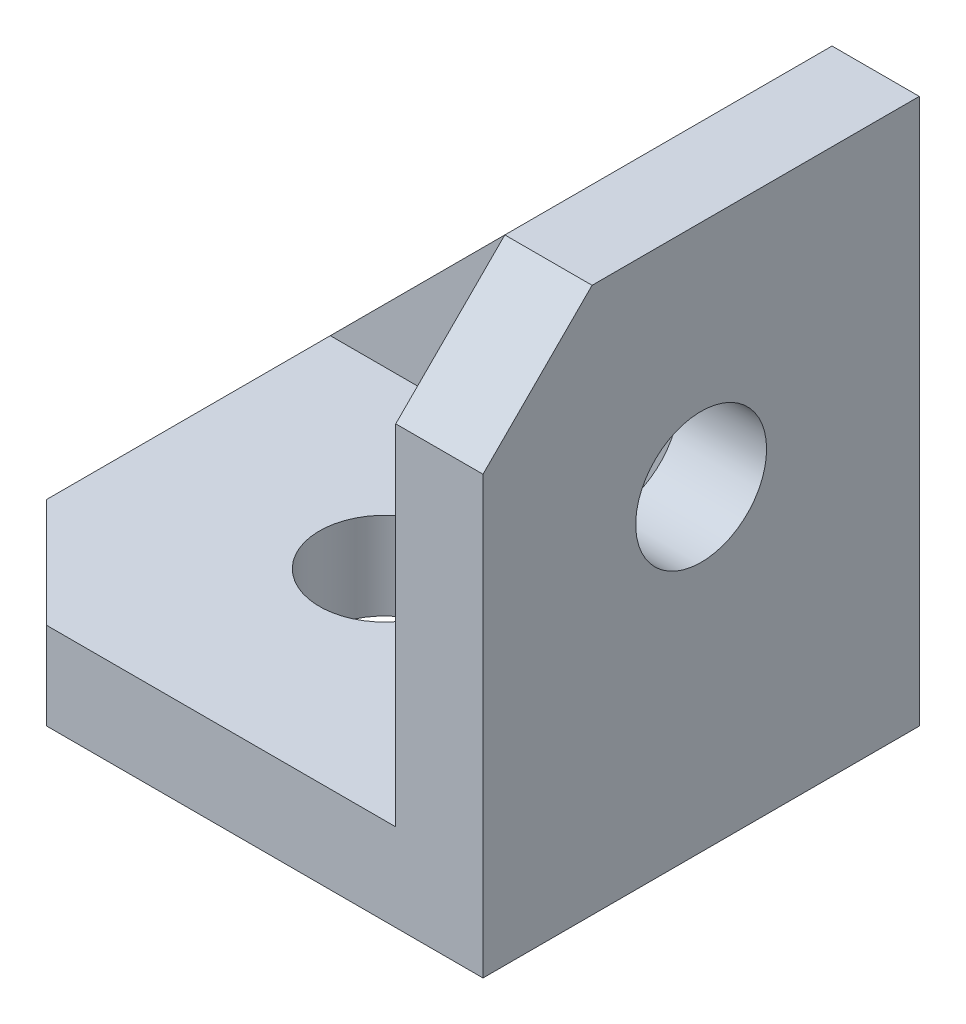
ISO-10303-21;
HEADER;
FILE_DESCRIPTION(('STEP AP214'),'2;1');
FILE_NAME('part.step','',(''),(''),'','','');
FILE_SCHEMA(('AUTOMOTIVE_DESIGN { 1 0 10303 214 1 1 1 1 }'));
ENDSEC;
DATA;
#1=APPLICATION_CONTEXT('core data for automotive mechanical design processes');
#2=APPLICATION_PROTOCOL_DEFINITION('international standard','automotive_design',2000,#1);
#3=PRODUCT_CONTEXT('',#1,'mechanical');
#4=PRODUCT('Part','Part','',(#3));
#5=PRODUCT_RELATED_PRODUCT_CATEGORY('part','',(#4));
#6=PRODUCT_DEFINITION_FORMATION('','',#4);
#7=PRODUCT_DEFINITION_CONTEXT('part definition',#1,'design');
#8=PRODUCT_DEFINITION('design','',#6,#7);
#9=PRODUCT_DEFINITION_SHAPE('','',#8);
#10=(LENGTH_UNIT() NAMED_UNIT(*) SI_UNIT(.MILLI.,.METRE.));
#11=(NAMED_UNIT(*) PLANE_ANGLE_UNIT() SI_UNIT($,.RADIAN.));
#12=(NAMED_UNIT(*) SI_UNIT($,.STERADIAN.) SOLID_ANGLE_UNIT());
#13=UNCERTAINTY_MEASURE_WITH_UNIT(LENGTH_MEASURE(1.E-05),#10,'distance_accuracy_value','');
#14=(GEOMETRIC_REPRESENTATION_CONTEXT(3) GLOBAL_UNCERTAINTY_ASSIGNED_CONTEXT((#13)) GLOBAL_UNIT_ASSIGNED_CONTEXT((#10,
#11,#12)) REPRESENTATION_CONTEXT('',''));
#15=CARTESIAN_POINT('',(0.,0.,0.));
#16=DIRECTION('',(0.,0.,1.));
#17=DIRECTION('',(1.,0.,0.));
#18=AXIS2_PLACEMENT_3D('',#15,#16,#17);
#19=CARTESIAN_POINT('',(-22.2500000000004,1010.,9.00023424550686));
#20=DIRECTION('',(0.,-1.,0.));
#21=DIRECTION('',(0.,0.,-1.));
#22=AXIS2_PLACEMENT_3D('',#19,#20,#21);
#23=PLANE('',#22);
#24=CARTESIAN_POINT('',(-32.75,1010.,-0.999765754493011));
#25=DIRECTION('',(0.,-1.,0.));
#26=DIRECTION('',(0.,0.,-1.));
#27=AXIS2_PLACEMENT_3D('',#24,#25,#26);
#28=CIRCLE('',#27,2.99999999999999);
#29=CARTESIAN_POINT('',(-32.75,1010.,-3.999765754493));
#30=VERTEX_POINT('',#29);
#31=EDGE_CURVE('E152',#30,#30,#28,.T.);
#32=ORIENTED_EDGE('',*,*,#31,.T.);
#33=EDGE_LOOP('',(#32));
#34=FACE_BOUND('',#33,.T.);
#35=DIRECTION('',(0.,0.,-1.));
#36=VECTOR('',#35,1.);
#37=CARTESIAN_POINT('',(-43.25,1010.,9.00023424550686));
#38=LINE('',#37,#36);
#39=CARTESIAN_POINT('',(-43.25,1010.,4.00023424550683));
#40=VERTEX_POINT('',#39);
#41=CARTESIAN_POINT('',(-43.25,1010.,-8.99976575449301));
#42=VERTEX_POINT('',#41);
#43=EDGE_CURVE('E159',#40,#42,#38,.T.);
#44=ORIENTED_EDGE('',*,*,#43,.F.);
#45=DIRECTION('',(0.707106781186543,0.,0.707106781186552));
#46=VECTOR('',#45,1.);
#47=CARTESIAN_POINT('',(-38.2499999999997,1010.,9.00023424550684));
#48=LINE('',#47,#46);
#49=CARTESIAN_POINT('',(-38.2499999999997,1010.,9.00023424550686));
#50=VERTEX_POINT('',#49);
#51=EDGE_CURVE('E45',#40,#50,#48,.T.);
#52=ORIENTED_EDGE('',*,*,#51,.T.);
#53=DIRECTION('',(-1.,0.,0.));
#54=VECTOR('',#53,1.);
#55=CARTESIAN_POINT('',(-22.2500000000004,1010.,9.00023424550686));
#56=LINE('',#55,#54);
#57=CARTESIAN_POINT('',(-22.2500000000004,1010.,9.00023424550686));
#58=VERTEX_POINT('',#57);
#59=EDGE_CURVE('E155',#58,#50,#56,.T.);
#60=ORIENTED_EDGE('',*,*,#59,.F.);
#61=DIRECTION('',(0.,0.,-1.));
#62=VECTOR('',#61,1.);
#63=CARTESIAN_POINT('',(-22.2500000000004,1010.,9.00023424550686));
#64=LINE('',#63,#62);
#65=CARTESIAN_POINT('',(-22.2500000000004,1010.,-8.99976575449314));
#66=VERTEX_POINT('',#65);
#67=EDGE_CURVE('E162',#58,#66,#64,.T.);
#68=ORIENTED_EDGE('',*,*,#67,.T.);
#69=DIRECTION('',(1.,0.,0.));
#70=VECTOR('',#69,1.);
#71=CARTESIAN_POINT('',(-22.2500000000006,1010.,-8.99976575449312));
#72=LINE('',#71,#70);
#73=EDGE_CURVE('E139',#42,#66,#72,.T.);
#74=ORIENTED_EDGE('',*,*,#73,.F.);
#75=EDGE_LOOP('',(#44,#52,#60,#68,#74));
#76=FACE_BOUND('',#75,.T.);
#77=ADVANCED_FACE('F37',(#34,#76),#23,.F.);
#78=CARTESIAN_POINT('',(-22.2500000000004,1031.,9.00023424550684));
#79=DIRECTION('',(1.,0.,0.));
#80=DIRECTION('',(0.,0.,-1.));
#81=AXIS2_PLACEMENT_3D('',#78,#79,#80);
#82=PLANE('',#81);
#83=CARTESIAN_POINT('',(-22.2500000000004,1020.5,-0.999765754493179));
#84=DIRECTION('',(1.,0.,0.));
#85=DIRECTION('',(0.,0.,-1.));
#86=AXIS2_PLACEMENT_3D('',#83,#84,#85);
#87=CIRCLE('',#86,2.99999999999989);
#88=CARTESIAN_POINT('',(-22.2500000000004,1020.5,-3.99976575449307));
#89=VERTEX_POINT('',#88);
#90=EDGE_CURVE('E148',#89,#89,#87,.T.);
#91=ORIENTED_EDGE('',*,*,#90,.T.);
#92=EDGE_LOOP('',(#91));
#93=FACE_BOUND('',#92,.T.);
#94=DIRECTION('',(0.,-1.,0.));
#95=VECTOR('',#94,1.);
#96=CARTESIAN_POINT('',(-22.2500000000004,1031.,9.00023424550684));
#97=LINE('',#96,#95);
#98=CARTESIAN_POINT('',(-22.2500000000004,1026.,9.00023424550684));
#99=VERTEX_POINT('',#98);
#100=EDGE_CURVE('E153',#99,#58,#97,.T.);
#101=ORIENTED_EDGE('',*,*,#100,.F.);
#102=DIRECTION('',(0.,-0.707106781186546,0.707106781186549));
#103=VECTOR('',#102,1.);
#104=CARTESIAN_POINT('',(-22.2500000000004,1031.,4.0002342455069));
#105=LINE('',#104,#103);
#106=CARTESIAN_POINT('',(-22.2500000000004,1031.,4.0002342455069));
#107=VERTEX_POINT('',#106);
#108=EDGE_CURVE('E194',#99,#107,#105,.F.);
#109=ORIENTED_EDGE('',*,*,#108,.T.);
#110=DIRECTION('',(0.,0.,-1.));
#111=VECTOR('',#110,1.);
#112=CARTESIAN_POINT('',(-22.2500000000004,1031.,9.00023424550684));
#113=LINE('',#112,#111);
#114=CARTESIAN_POINT('',(-22.2500000000004,1031.,-8.99976575449315));
#115=VERTEX_POINT('',#114);
#116=EDGE_CURVE('E165',#107,#115,#113,.T.);
#117=ORIENTED_EDGE('',*,*,#116,.T.);
#118=DIRECTION('',(0.,1.,0.));
#119=VECTOR('',#118,1.);
#120=CARTESIAN_POINT('',(-22.2500000000004,1031.,-8.99976575449315));
#121=LINE('',#120,#119);
#122=EDGE_CURVE('E176',#66,#115,#121,.T.);
#123=ORIENTED_EDGE('',*,*,#122,.F.);
#124=ORIENTED_EDGE('',*,*,#67,.F.);
#125=EDGE_LOOP('',(#101,#109,#117,#123,#124));
#126=FACE_BOUND('',#125,.T.);
#127=ADVANCED_FACE('F210',(#93,#126),#82,.F.);
#128=CARTESIAN_POINT('',(-43.2499999999996,1006.,9.00023424550684));
#129=DIRECTION('',(0.,-1.,0.));
#130=DIRECTION('',(0.,0.,-1.));
#131=AXIS2_PLACEMENT_3D('',#128,#129,#130);
#132=PLANE('',#131);
#133=DIRECTION('',(-1.,0.,0.));
#134=VECTOR('',#133,1.);
#135=CARTESIAN_POINT('',(-43.2499999999996,1006.,-10.9997657544931));
#136=LINE('',#135,#134);
#137=CARTESIAN_POINT('',(-18.25,1006.,-10.9997657544931));
#138=VERTEX_POINT('',#137);
#139=CARTESIAN_POINT('',(-43.2499999999996,1006.,-10.9997657544931));
#140=VERTEX_POINT('',#139);
#141=EDGE_CURVE('E133',#138,#140,#136,.T.);
#142=ORIENTED_EDGE('',*,*,#141,.F.);
#143=DIRECTION('',(0.,0.,-1.));
#144=VECTOR('',#143,1.);
#145=CARTESIAN_POINT('',(-18.25,1006.,9.00023424550684));
#146=LINE('',#145,#144);
#147=CARTESIAN_POINT('',(-18.25,1006.,9.00023424550684));
#148=VERTEX_POINT('',#147);
#149=EDGE_CURVE('E115',#148,#138,#146,.T.);
#150=ORIENTED_EDGE('',*,*,#149,.F.);
#151=DIRECTION('',(1.,0.,0.));
#152=VECTOR('',#151,1.);
#153=CARTESIAN_POINT('',(-43.2499999999996,1006.,9.00023424550684));
#154=LINE('',#153,#152);
#155=CARTESIAN_POINT('',(-38.2499999999997,1006.,9.00023424550684));
#156=VERTEX_POINT('',#155);
#157=EDGE_CURVE('E171',#156,#148,#154,.T.);
#158=ORIENTED_EDGE('',*,*,#157,.F.);
#159=DIRECTION('',(-0.707106781186543,0.,-0.707106781186552));
#160=VECTOR('',#159,1.);
#161=CARTESIAN_POINT('',(-40.7499999999996,1006.,6.50023424550687));
#162=LINE('',#161,#160);
#163=CARTESIAN_POINT('',(-43.2499999999996,1006.,4.00023424550684));
#164=VERTEX_POINT('',#163);
#165=EDGE_CURVE('E188',#156,#164,#162,.T.);
#166=ORIENTED_EDGE('',*,*,#165,.T.);
#167=DIRECTION('',(0.,0.,-1.));
#168=VECTOR('',#167,1.);
#169=CARTESIAN_POINT('',(-43.2499999999996,1006.,9.00023424550684));
#170=LINE('',#169,#168);
#171=EDGE_CURVE('E168',#164,#140,#170,.T.);
#172=ORIENTED_EDGE('',*,*,#171,.T.);
#173=EDGE_LOOP('',(#142,#150,#158,#166,#172));
#174=FACE_BOUND('',#173,.T.);
#175=CARTESIAN_POINT('',(-32.75,1006.,-0.999765754493011));
#176=DIRECTION('',(0.,-1.,0.));
#177=DIRECTION('',(0.,0.,-1.));
#178=AXIS2_PLACEMENT_3D('',#175,#176,#177);
#179=CIRCLE('',#178,2.99999999999999);
#180=CARTESIAN_POINT('',(-32.75,1006.,-3.999765754493));
#181=VERTEX_POINT('',#180);
#182=EDGE_CURVE('E149',#181,#181,#179,.T.);
#183=ORIENTED_EDGE('',*,*,#182,.F.);
#184=EDGE_LOOP('',(#183));
#185=FACE_BOUND('',#184,.T.);
#186=ADVANCED_FACE('F215',(#174,#185),#132,.T.);
#187=CARTESIAN_POINT('',(-43.2499999999996,1031.,9.00023424550681));
#188=DIRECTION('',(0.,0.,1.));
#189=DIRECTION('',(0.,-1.,0.));
#190=AXIS2_PLACEMENT_3D('',#187,#188,#189);
#191=PLANE('',#190);
#192=DIRECTION('',(0.,-1.,0.));
#193=VECTOR('',#192,1.);
#194=CARTESIAN_POINT('',(-18.25,1031.,9.00023424550681));
#195=LINE('',#194,#193);
#196=CARTESIAN_POINT('',(-18.25,1026.,9.00023424550682));
#197=VERTEX_POINT('',#196);
#198=EDGE_CURVE('E128',#197,#148,#195,.T.);
#199=ORIENTED_EDGE('',*,*,#198,.F.);
#200=DIRECTION('',(-1.,0.,0.));
#201=VECTOR('',#200,1.);
#202=CARTESIAN_POINT('',(-43.2499999999996,1026.,9.00023424550682));
#203=LINE('',#202,#201);
#204=EDGE_CURVE('E58',#197,#99,#203,.T.);
#205=ORIENTED_EDGE('',*,*,#204,.T.);
#206=ORIENTED_EDGE('',*,*,#100,.T.);
#207=ORIENTED_EDGE('',*,*,#59,.T.);
#208=DIRECTION('',(0.,-1.,0.));
#209=VECTOR('',#208,1.);
#210=CARTESIAN_POINT('',(-38.2499999999997,1006.,9.00023424550684));
#211=LINE('',#210,#209);
#212=EDGE_CURVE('E191',#50,#156,#211,.T.);
#213=ORIENTED_EDGE('',*,*,#212,.T.);
#214=ORIENTED_EDGE('',*,*,#157,.T.);
#215=EDGE_LOOP('',(#199,#205,#206,#207,#213,#214));
#216=FACE_BOUND('',#215,.T.);
#217=ADVANCED_FACE('F206',(#216),#191,.T.);
#218=CARTESIAN_POINT('',(-43.2499999999996,1031.,-30.9997657544932));
#219=DIRECTION('',(0.,1.,0.));
#220=DIRECTION('',(0.,0.,1.));
#221=AXIS2_PLACEMENT_3D('',#218,#219,#220);
#222=PLANE('',#221);
#223=DIRECTION('',(1.,0.,0.));
#224=VECTOR('',#223,1.);
#225=CARTESIAN_POINT('',(-48.25,1031.,-10.9997657544931));
#226=LINE('',#225,#224);
#227=CARTESIAN_POINT('',(-22.2500000000002,1031.,-10.999765754493));
#228=VERTEX_POINT('',#227);
#229=CARTESIAN_POINT('',(-18.25,1031.,-10.9997657544931));
#230=VERTEX_POINT('',#229);
#231=EDGE_CURVE('E120',#228,#230,#226,.T.);
#232=ORIENTED_EDGE('',*,*,#231,.F.);
#233=EDGE_CURVE('E158',#115,#228,#113,.T.);
#234=ORIENTED_EDGE('',*,*,#233,.F.);
#235=ORIENTED_EDGE('',*,*,#116,.F.);
#236=DIRECTION('',(1.,0.,0.));
#237=VECTOR('',#236,1.);
#238=CARTESIAN_POINT('',(-43.2499999999996,1031.,4.0002342455069));
#239=LINE('',#238,#237);
#240=CARTESIAN_POINT('',(-18.25,1031.,4.0002342455069));
#241=VERTEX_POINT('',#240);
#242=EDGE_CURVE('E127',#107,#241,#239,.T.);
#243=ORIENTED_EDGE('',*,*,#242,.T.);
#244=DIRECTION('',(0.,0.,1.));
#245=VECTOR('',#244,1.);
#246=CARTESIAN_POINT('',(-18.25,1031.,-30.9997657544932));
#247=LINE('',#246,#245);
#248=EDGE_CURVE('E112',#230,#241,#247,.T.);
#249=ORIENTED_EDGE('',*,*,#248,.F.);
#250=EDGE_LOOP('',(#232,#234,#235,#243,#249));
#251=FACE_BOUND('',#250,.T.);
#252=ADVANCED_FACE('F124',(#251),#222,.T.);
#253=CARTESIAN_POINT('',(-43.2499999999996,0.,0.));
#254=DIRECTION('',(1.,0.,0.));
#255=DIRECTION('',(0.,0.,-1.));
#256=AXIS2_PLACEMENT_3D('',#253,#254,#255);
#257=PLANE('',#256);
#258=DIRECTION('',(0.,0.,-1.));
#259=VECTOR('',#258,1.);
#260=CARTESIAN_POINT('',(-43.25,1010.,9.00023424550708));
#261=LINE('',#260,#259);
#262=CARTESIAN_POINT('',(-43.2500000000002,1010.,-10.9997657544929));
#263=VERTEX_POINT('',#262);
#264=EDGE_CURVE('E142',#42,#263,#261,.T.);
#265=ORIENTED_EDGE('',*,*,#264,.T.);
#266=DIRECTION('',(0.,-1.,0.));
#267=VECTOR('',#266,1.);
#268=CARTESIAN_POINT('',(-43.2499999999996,0.,-10.9997657544931));
#269=LINE('',#268,#267);
#270=EDGE_CURVE('E131',#263,#140,#269,.T.);
#271=ORIENTED_EDGE('',*,*,#270,.T.);
#272=ORIENTED_EDGE('',*,*,#171,.F.);
#273=DIRECTION('',(0.,1.,0.));
#274=VECTOR('',#273,1.);
#275=CARTESIAN_POINT('',(-43.2499999999996,1010.,4.00023424550683));
#276=LINE('',#275,#274);
#277=EDGE_CURVE('E186',#164,#40,#276,.T.);
#278=ORIENTED_EDGE('',*,*,#277,.T.);
#279=ORIENTED_EDGE('',*,*,#43,.T.);
#280=EDGE_LOOP('',(#265,#271,#272,#278,#279));
#281=FACE_BOUND('',#280,.T.);
#282=ADVANCED_FACE('F213',(#281),#257,.F.);
#283=CARTESIAN_POINT('',(-18.25,0.,0.));
#284=DIRECTION('',(1.,0.,0.));
#285=DIRECTION('',(0.,0.,-1.));
#286=AXIS2_PLACEMENT_3D('',#283,#284,#285);
#287=PLANE('',#286);
#288=DIRECTION('',(0.,-1.,0.));
#289=VECTOR('',#288,1.);
#290=CARTESIAN_POINT('',(-18.25,1031.,-10.9997657544931));
#291=LINE('',#290,#289);
#292=EDGE_CURVE('E108',#230,#138,#291,.T.);
#293=ORIENTED_EDGE('',*,*,#292,.F.);
#294=ORIENTED_EDGE('',*,*,#248,.T.);
#295=DIRECTION('',(0.,0.707106781186546,-0.707106781186549));
#296=VECTOR('',#295,1.);
#297=CARTESIAN_POINT('',(-18.25,517.500117122756,517.500117122754));
#298=LINE('',#297,#296);
#299=EDGE_CURVE('E183',#241,#197,#298,.F.);
#300=ORIENTED_EDGE('',*,*,#299,.T.);
#301=ORIENTED_EDGE('',*,*,#198,.T.);
#302=ORIENTED_EDGE('',*,*,#149,.T.);
#303=EDGE_LOOP('',(#293,#294,#300,#301,#302));
#304=FACE_BOUND('',#303,.T.);
#305=CARTESIAN_POINT('',(-18.25,1020.5,-0.999765754493179));
#306=DIRECTION('',(1.,0.,0.));
#307=DIRECTION('',(0.,0.,-1.));
#308=AXIS2_PLACEMENT_3D('',#305,#306,#307);
#309=CIRCLE('',#308,2.99999999999989);
#310=CARTESIAN_POINT('',(-18.25,1020.5,-3.99976575449307));
#311=VERTEX_POINT('',#310);
#312=EDGE_CURVE('E145',#311,#311,#309,.T.);
#313=ORIENTED_EDGE('',*,*,#312,.F.);
#314=EDGE_LOOP('',(#313));
#315=FACE_BOUND('',#314,.T.);
#316=ADVANCED_FACE('F110',(#304,#315),#287,.T.);
#317=CARTESIAN_POINT('',(-32.75,1006.,-0.999765754493011));
#318=DIRECTION('',(0.,-1.,0.));
#319=DIRECTION('',(0.,0.,-1.));
#320=AXIS2_PLACEMENT_3D('',#317,#318,#319);
#321=CYLINDRICAL_SURFACE('',#320,2.99999999999999);
#322=ORIENTED_EDGE('',*,*,#182,.T.);
#323=EDGE_LOOP('',(#322));
#324=FACE_BOUND('',#323,.T.);
#325=ORIENTED_EDGE('',*,*,#31,.F.);
#326=EDGE_LOOP('',(#325));
#327=FACE_BOUND('',#326,.T.);
#328=ADVANCED_FACE('F229',(#324,#327),#321,.F.);
#329=CARTESIAN_POINT('',(-18.25,1020.5,-0.999765754493179));
#330=DIRECTION('',(1.,0.,0.));
#331=DIRECTION('',(0.,0.,-1.));
#332=AXIS2_PLACEMENT_3D('',#329,#330,#331);
#333=CYLINDRICAL_SURFACE('',#332,2.99999999999989);
#334=ORIENTED_EDGE('',*,*,#312,.T.);
#335=EDGE_LOOP('',(#334));
#336=FACE_BOUND('',#335,.T.);
#337=ORIENTED_EDGE('',*,*,#90,.F.);
#338=EDGE_LOOP('',(#337));
#339=FACE_BOUND('',#338,.T.);
#340=ADVANCED_FACE('F222',(#336,#339),#333,.F.);
#341=CARTESIAN_POINT('',(-43.2500000000002,1010.,-10.9997657544929));
#342=DIRECTION('',(-0.707106781186546,0.707106781186549,0.));
#343=DIRECTION('',(0.707106781186549,0.707106781186546,0.));
#344=AXIS2_PLACEMENT_3D('',#341,#342,#343);
#345=PLANE('',#344);
#346=DIRECTION('',(0.707106781186549,0.707106781186546,0.));
#347=VECTOR('',#346,1.);
#348=CARTESIAN_POINT('',(-43.2500000000002,1010.,-10.9997657544929));
#349=LINE('',#348,#347);
#350=EDGE_CURVE('E11',#263,#228,#349,.T.);
#351=ORIENTED_EDGE('',*,*,#350,.F.);
#352=ORIENTED_EDGE('',*,*,#264,.F.);
#353=DIRECTION('',(0.707106781186549,0.707106781186546,0.));
#354=VECTOR('',#353,1.);
#355=CARTESIAN_POINT('',(-43.2500000000001,1010.,-8.9997657544929));
#356=LINE('',#355,#354);
#357=EDGE_CURVE('E137',#42,#115,#356,.T.);
#358=ORIENTED_EDGE('',*,*,#357,.T.);
#359=ORIENTED_EDGE('',*,*,#233,.T.);
#360=EDGE_LOOP('',(#351,#352,#358,#359));
#361=FACE_BOUND('',#360,.T.);
#362=ADVANCED_FACE('F220',(#361),#345,.T.);
#363=CARTESIAN_POINT('',(-30.75,1018.5,-8.99976575449304));
#364=DIRECTION('',(0.,0.,-1.));
#365=DIRECTION('',(-1.,0.,0.));
#366=AXIS2_PLACEMENT_3D('',#363,#364,#365);
#367=PLANE('',#366);
#368=ORIENTED_EDGE('',*,*,#357,.F.);
#369=ORIENTED_EDGE('',*,*,#73,.T.);
#370=ORIENTED_EDGE('',*,*,#122,.T.);
#371=EDGE_LOOP('',(#368,#369,#370));
#372=FACE_BOUND('',#371,.T.);
#373=ADVANCED_FACE('F219',(#372),#367,.F.);
#374=CARTESIAN_POINT('',(-43.2499999999996,1031.,4.0002342455069));
#375=DIRECTION('',(0.,-0.707106781186549,-0.707106781186546));
#376=DIRECTION('',(1.,0.,0.));
#377=AXIS2_PLACEMENT_3D('',#374,#375,#376);
#378=PLANE('',#377);
#379=ORIENTED_EDGE('',*,*,#108,.F.);
#380=ORIENTED_EDGE('',*,*,#204,.F.);
#381=ORIENTED_EDGE('',*,*,#299,.F.);
#382=ORIENTED_EDGE('',*,*,#242,.F.);
#383=EDGE_LOOP('',(#379,#380,#381,#382));
#384=FACE_BOUND('',#383,.T.);
#385=ADVANCED_FACE('F218',(#384),#378,.F.);
#386=CARTESIAN_POINT('',(-38.2499999999997,1031.,9.00023424550681));
#387=DIRECTION('',(-0.707106781186552,0.,0.707106781186543));
#388=DIRECTION('',(0.,1.,0.));
#389=AXIS2_PLACEMENT_3D('',#386,#387,#388);
#390=PLANE('',#389);
#391=ORIENTED_EDGE('',*,*,#51,.F.);
#392=ORIENTED_EDGE('',*,*,#277,.F.);
#393=ORIENTED_EDGE('',*,*,#165,.F.);
#394=ORIENTED_EDGE('',*,*,#212,.F.);
#395=EDGE_LOOP('',(#391,#392,#393,#394));
#396=FACE_BOUND('',#395,.T.);
#397=ADVANCED_FACE('F39',(#396),#390,.T.);
#398=CARTESIAN_POINT('',(-48.25,1031.,-10.9997657544931));
#399=DIRECTION('',(0.,0.,1.));
#400=DIRECTION('',(1.,0.,0.));
#401=AXIS2_PLACEMENT_3D('',#398,#399,#400);
#402=PLANE('',#401);
#403=ORIENTED_EDGE('',*,*,#141,.T.);
#404=ORIENTED_EDGE('',*,*,#270,.F.);
#405=ORIENTED_EDGE('',*,*,#350,.T.);
#406=ORIENTED_EDGE('',*,*,#231,.T.);
#407=ORIENTED_EDGE('',*,*,#292,.T.);
#408=EDGE_LOOP('',(#403,#404,#405,#406,#407));
#409=FACE_BOUND('',#408,.T.);
#410=ADVANCED_FACE('F130',(#409),#402,.F.);
#411=CLOSED_SHELL('',(#77,#127,#186,#217,#252,#282,#316,#328,#340,#362,#373,#385,#397,#410));
#412=MANIFOLD_SOLID_BREP('B2',#411);
#413=ADVANCED_BREP_SHAPE_REPRESENTATION('',(#18,#412),#14);
#414=SHAPE_DEFINITION_REPRESENTATION(#9,#413);
ENDSEC;
END-ISO-10303-21;
